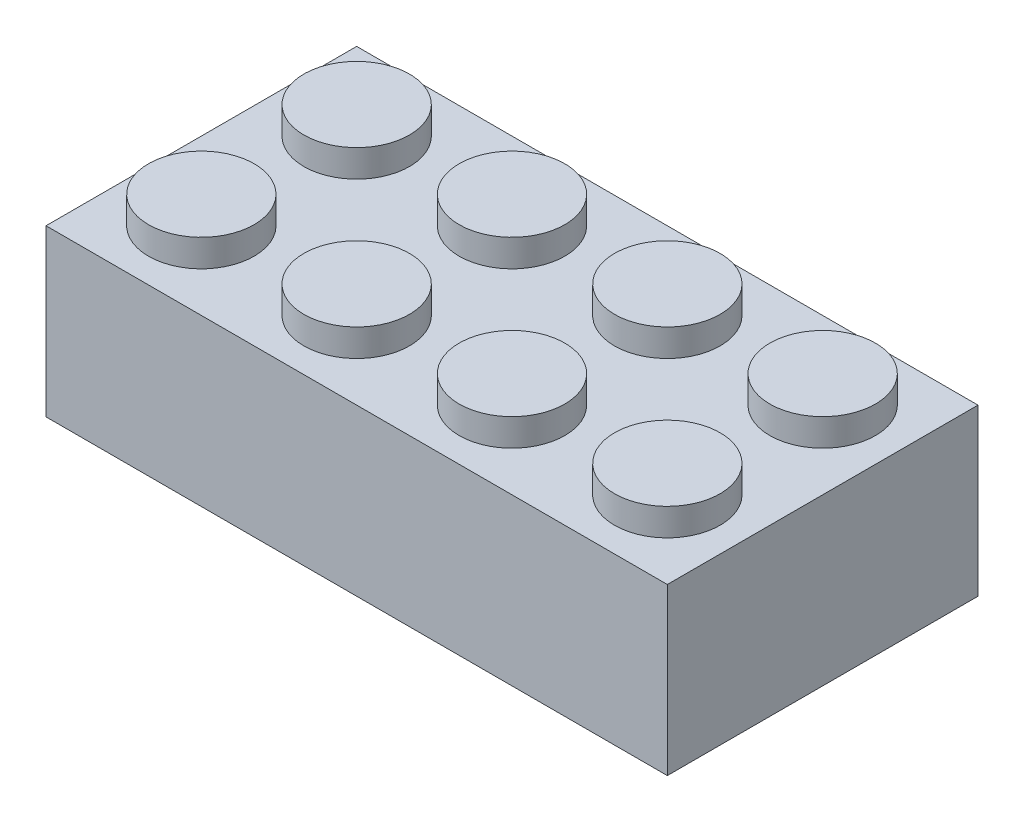
ISO-10303-21;
HEADER;
FILE_DESCRIPTION(('STEP AP214'),'2;1');
FILE_NAME('part.step','',(''),(''),'','','');
FILE_SCHEMA(('AUTOMOTIVE_DESIGN { 1 0 10303 214 1 1 1 1 }'));
ENDSEC;
DATA;
#1=APPLICATION_CONTEXT('core data for automotive mechanical design processes');
#2=APPLICATION_PROTOCOL_DEFINITION('international standard','automotive_design',2000,#1);
#3=PRODUCT_CONTEXT('',#1,'mechanical');
#4=PRODUCT('Part','Part','',(#3));
#5=PRODUCT_RELATED_PRODUCT_CATEGORY('part','',(#4));
#6=PRODUCT_DEFINITION_FORMATION('','',#4);
#7=PRODUCT_DEFINITION_CONTEXT('part definition',#1,'design');
#8=PRODUCT_DEFINITION('design','',#6,#7);
#9=PRODUCT_DEFINITION_SHAPE('','',#8);
#10=(LENGTH_UNIT() NAMED_UNIT(*) SI_UNIT(.MILLI.,.METRE.));
#11=(NAMED_UNIT(*) PLANE_ANGLE_UNIT() SI_UNIT($,.RADIAN.));
#12=(NAMED_UNIT(*) SI_UNIT($,.STERADIAN.) SOLID_ANGLE_UNIT());
#13=UNCERTAINTY_MEASURE_WITH_UNIT(LENGTH_MEASURE(1.E-05),#10,'distance_accuracy_value','');
#14=(GEOMETRIC_REPRESENTATION_CONTEXT(3) GLOBAL_UNCERTAINTY_ASSIGNED_CONTEXT((#13)) GLOBAL_UNIT_ASSIGNED_CONTEXT((#10,
#11,#12)) REPRESENTATION_CONTEXT('',''));
#15=CARTESIAN_POINT('',(0.,0.,0.));
#16=DIRECTION('',(0.,0.,1.));
#17=DIRECTION('',(1.,0.,0.));
#18=AXIS2_PLACEMENT_3D('',#15,#16,#17);
#19=CARTESIAN_POINT('',(15.875,4.2291,7.9375));
#20=DIRECTION('',(0.,1.,0.));
#21=DIRECTION('',(0.,0.,1.));
#22=AXIS2_PLACEMENT_3D('',#19,#20,#21);
#23=PLANE('',#22);
#24=CARTESIAN_POINT('',(11.90625,4.2291,3.96875));
#25=DIRECTION('',(0.,1.,0.));
#26=DIRECTION('',(0.,0.,1.));
#27=AXIS2_PLACEMENT_3D('',#24,#25,#26);
#28=CIRCLE('',#27,2.69875);
#29=CARTESIAN_POINT('',(11.90625,4.2291,6.6675));
#30=VERTEX_POINT('',#29);
#31=EDGE_CURVE('E692',#30,#30,#28,.T.);
#32=ORIENTED_EDGE('',*,*,#31,.F.);
#33=EDGE_LOOP('',(#32));
#34=FACE_BOUND('',#33,.T.);
#35=DIRECTION('',(0.,0.,-1.));
#36=VECTOR('',#35,1.);
#37=CARTESIAN_POINT('',(15.875,4.2291,-7.9375));
#38=LINE('',#37,#36);
#39=CARTESIAN_POINT('',(15.875,4.2291,7.9375));
#40=VERTEX_POINT('',#39);
#41=CARTESIAN_POINT('',(15.875,4.2291,-7.9375));
#42=VERTEX_POINT('',#41);
#43=EDGE_CURVE('E186',#40,#42,#38,.T.);
#44=ORIENTED_EDGE('',*,*,#43,.T.);
#45=DIRECTION('',(-1.,0.,0.));
#46=VECTOR('',#45,1.);
#47=CARTESIAN_POINT('',(-15.875,4.2291,-7.9375));
#48=LINE('',#47,#46);
#49=CARTESIAN_POINT('',(-15.875,4.2291,-7.9375));
#50=VERTEX_POINT('',#49);
#51=EDGE_CURVE('E116',#42,#50,#48,.T.);
#52=ORIENTED_EDGE('',*,*,#51,.T.);
#53=DIRECTION('',(0.,0.,1.));
#54=VECTOR('',#53,1.);
#55=CARTESIAN_POINT('',(-15.875,4.2291,-7.9375));
#56=LINE('',#55,#54);
#57=CARTESIAN_POINT('',(-15.875,4.2291,7.9375));
#58=VERTEX_POINT('',#57);
#59=EDGE_CURVE('E190',#50,#58,#56,.T.);
#60=ORIENTED_EDGE('',*,*,#59,.T.);
#61=DIRECTION('',(1.,0.,0.));
#62=VECTOR('',#61,1.);
#63=CARTESIAN_POINT('',(-15.875,4.2291,7.9375));
#64=LINE('',#63,#62);
#65=EDGE_CURVE('E86',#58,#40,#64,.T.);
#66=ORIENTED_EDGE('',*,*,#65,.T.);
#67=EDGE_LOOP('',(#44,#52,#60,#66));
#68=FACE_BOUND('',#67,.T.);
#69=CARTESIAN_POINT('',(3.96875000000001,4.2291,3.96875));
#70=DIRECTION('',(0.,1.,0.));
#71=DIRECTION('',(0.,0.,1.));
#72=AXIS2_PLACEMENT_3D('',#69,#70,#71);
#73=CIRCLE('',#72,2.69875);
#74=CARTESIAN_POINT('',(3.96875000000001,4.2291,6.6675));
#75=VERTEX_POINT('',#74);
#76=EDGE_CURVE('E684',#75,#75,#73,.T.);
#77=ORIENTED_EDGE('',*,*,#76,.F.);
#78=EDGE_LOOP('',(#77));
#79=FACE_BOUND('',#78,.T.);
#80=CARTESIAN_POINT('',(-3.96874999999999,4.2291,3.96875));
#81=DIRECTION('',(0.,1.,0.));
#82=DIRECTION('',(0.,0.,1.));
#83=AXIS2_PLACEMENT_3D('',#80,#81,#82);
#84=CIRCLE('',#83,2.69875);
#85=CARTESIAN_POINT('',(-3.96874999999999,4.2291,6.6675));
#86=VERTEX_POINT('',#85);
#87=EDGE_CURVE('E215',#86,#86,#84,.T.);
#88=ORIENTED_EDGE('',*,*,#87,.F.);
#89=EDGE_LOOP('',(#88));
#90=FACE_BOUND('',#89,.T.);
#91=CARTESIAN_POINT('',(-11.90625,4.2291,3.96875));
#92=DIRECTION('',(0.,1.,0.));
#93=DIRECTION('',(0.,0.,1.));
#94=AXIS2_PLACEMENT_3D('',#91,#92,#93);
#95=CIRCLE('',#94,2.69875);
#96=CARTESIAN_POINT('',(-11.90625,4.2291,6.6675));
#97=VERTEX_POINT('',#96);
#98=EDGE_CURVE('E223',#97,#97,#95,.T.);
#99=ORIENTED_EDGE('',*,*,#98,.F.);
#100=EDGE_LOOP('',(#99));
#101=FACE_BOUND('',#100,.T.);
#102=CARTESIAN_POINT('',(11.90625,4.2291,-3.96875));
#103=DIRECTION('',(0.,1.,0.));
#104=DIRECTION('',(0.,0.,1.));
#105=AXIS2_PLACEMENT_3D('',#102,#103,#104);
#106=CIRCLE('',#105,2.69875);
#107=CARTESIAN_POINT('',(11.90625,4.2291,-1.27));
#108=VERTEX_POINT('',#107);
#109=EDGE_CURVE('E231',#108,#108,#106,.T.);
#110=ORIENTED_EDGE('',*,*,#109,.F.);
#111=EDGE_LOOP('',(#110));
#112=FACE_BOUND('',#111,.T.);
#113=CARTESIAN_POINT('',(3.96875000000001,4.2291,-3.96875));
#114=DIRECTION('',(0.,1.,0.));
#115=DIRECTION('',(0.,0.,1.));
#116=AXIS2_PLACEMENT_3D('',#113,#114,#115);
#117=CIRCLE('',#116,2.69875);
#118=CARTESIAN_POINT('',(3.96875000000001,4.2291,-1.27));
#119=VERTEX_POINT('',#118);
#120=EDGE_CURVE('E237',#119,#119,#117,.T.);
#121=ORIENTED_EDGE('',*,*,#120,.F.);
#122=EDGE_LOOP('',(#121));
#123=FACE_BOUND('',#122,.T.);
#124=CARTESIAN_POINT('',(-3.96874999999999,4.2291,-3.96875));
#125=DIRECTION('',(0.,1.,0.));
#126=DIRECTION('',(0.,0.,1.));
#127=AXIS2_PLACEMENT_3D('',#124,#125,#126);
#128=CIRCLE('',#127,2.69875);
#129=CARTESIAN_POINT('',(-3.96874999999999,4.2291,-1.27));
#130=VERTEX_POINT('',#129);
#131=EDGE_CURVE('E245',#130,#130,#128,.T.);
#132=ORIENTED_EDGE('',*,*,#131,.F.);
#133=EDGE_LOOP('',(#132));
#134=FACE_BOUND('',#133,.T.);
#135=CARTESIAN_POINT('',(-11.90625,4.2291,-3.96875));
#136=DIRECTION('',(0.,1.,0.));
#137=DIRECTION('',(0.,0.,1.));
#138=AXIS2_PLACEMENT_3D('',#135,#136,#137);
#139=CIRCLE('',#138,2.69875);
#140=CARTESIAN_POINT('',(-11.90625,4.2291,-1.27));
#141=VERTEX_POINT('',#140);
#142=EDGE_CURVE('E251',#141,#141,#139,.T.);
#143=ORIENTED_EDGE('',*,*,#142,.F.);
#144=EDGE_LOOP('',(#143));
#145=FACE_BOUND('',#144,.T.);
#146=ADVANCED_FACE('F59',(#34,#68,#79,#90,#101,#112,#123,#134,#145),#23,.T.);
#147=CARTESIAN_POINT('',(15.875,4.2291,-7.9375));
#148=DIRECTION('',(-1.,0.,0.));
#149=DIRECTION('',(0.,0.,1.));
#150=AXIS2_PLACEMENT_3D('',#147,#148,#149);
#151=PLANE('',#150);
#152=DIRECTION('',(0.,0.,-1.));
#153=VECTOR('',#152,1.);
#154=CARTESIAN_POINT('',(15.875,-4.2291,-7.9375));
#155=LINE('',#154,#153);
#156=CARTESIAN_POINT('',(15.875,-4.2291,7.9375));
#157=VERTEX_POINT('',#156);
#158=CARTESIAN_POINT('',(15.875,-4.2291,-7.9375));
#159=VERTEX_POINT('',#158);
#160=EDGE_CURVE('E185',#157,#159,#155,.T.);
#161=ORIENTED_EDGE('',*,*,#160,.T.);
#162=DIRECTION('',(0.,-1.,0.));
#163=VECTOR('',#162,1.);
#164=CARTESIAN_POINT('',(15.875,4.2291,-7.9375));
#165=LINE('',#164,#163);
#166=EDGE_CURVE('E213',#42,#159,#165,.T.);
#167=ORIENTED_EDGE('',*,*,#166,.F.);
#168=ORIENTED_EDGE('',*,*,#43,.F.);
#169=DIRECTION('',(0.,-1.,0.));
#170=VECTOR('',#169,1.);
#171=CARTESIAN_POINT('',(15.875,4.2291,7.9375));
#172=LINE('',#171,#170);
#173=EDGE_CURVE('E194',#40,#157,#172,.T.);
#174=ORIENTED_EDGE('',*,*,#173,.T.);
#175=EDGE_LOOP('',(#161,#167,#168,#174));
#176=FACE_BOUND('',#175,.T.);
#177=ADVANCED_FACE('F293',(#176),#151,.F.);
#178=CARTESIAN_POINT('',(-15.875,4.2291,-7.9375));
#179=DIRECTION('',(0.,0.,1.));
#180=DIRECTION('',(1.,0.,0.));
#181=AXIS2_PLACEMENT_3D('',#178,#179,#180);
#182=PLANE('',#181);
#183=DIRECTION('',(-1.,0.,0.));
#184=VECTOR('',#183,1.);
#185=CARTESIAN_POINT('',(-15.875,-4.2291,-7.9375));
#186=LINE('',#185,#184);
#187=CARTESIAN_POINT('',(-15.875,-4.2291,-7.9375));
#188=VERTEX_POINT('',#187);
#189=EDGE_CURVE('E197',#159,#188,#186,.T.);
#190=ORIENTED_EDGE('',*,*,#189,.T.);
#191=DIRECTION('',(0.,-1.,0.));
#192=VECTOR('',#191,1.);
#193=CARTESIAN_POINT('',(-15.875,4.2291,-7.9375));
#194=LINE('',#193,#192);
#195=EDGE_CURVE('E209',#50,#188,#194,.T.);
#196=ORIENTED_EDGE('',*,*,#195,.F.);
#197=ORIENTED_EDGE('',*,*,#51,.F.);
#198=ORIENTED_EDGE('',*,*,#166,.T.);
#199=EDGE_LOOP('',(#190,#196,#197,#198));
#200=FACE_BOUND('',#199,.T.);
#201=ADVANCED_FACE('F298',(#200),#182,.F.);
#202=CARTESIAN_POINT('',(-15.875,4.2291,-7.9375));
#203=DIRECTION('',(1.,0.,0.));
#204=DIRECTION('',(0.,0.,-1.));
#205=AXIS2_PLACEMENT_3D('',#202,#203,#204);
#206=PLANE('',#205);
#207=DIRECTION('',(0.,0.,1.));
#208=VECTOR('',#207,1.);
#209=CARTESIAN_POINT('',(-15.875,-4.2291,-7.9375));
#210=LINE('',#209,#208);
#211=CARTESIAN_POINT('',(-15.875,-4.2291,7.9375));
#212=VERTEX_POINT('',#211);
#213=EDGE_CURVE('E199',#188,#212,#210,.T.);
#214=ORIENTED_EDGE('',*,*,#213,.T.);
#215=DIRECTION('',(0.,-1.,0.));
#216=VECTOR('',#215,1.);
#217=CARTESIAN_POINT('',(-15.875,4.2291,7.9375));
#218=LINE('',#217,#216);
#219=EDGE_CURVE('E206',#58,#212,#218,.T.);
#220=ORIENTED_EDGE('',*,*,#219,.F.);
#221=ORIENTED_EDGE('',*,*,#59,.F.);
#222=ORIENTED_EDGE('',*,*,#195,.T.);
#223=EDGE_LOOP('',(#214,#220,#221,#222));
#224=FACE_BOUND('',#223,.T.);
#225=ADVANCED_FACE('F310',(#224),#206,.F.);
#226=CARTESIAN_POINT('',(-15.875,4.2291,7.9375));
#227=DIRECTION('',(0.,0.,-1.));
#228=DIRECTION('',(-1.,0.,0.));
#229=AXIS2_PLACEMENT_3D('',#226,#227,#228);
#230=PLANE('',#229);
#231=DIRECTION('',(1.,0.,0.));
#232=VECTOR('',#231,1.);
#233=CARTESIAN_POINT('',(-15.875,-4.2291,7.9375));
#234=LINE('',#233,#232);
#235=EDGE_CURVE('E108',#212,#157,#234,.T.);
#236=ORIENTED_EDGE('',*,*,#235,.T.);
#237=ORIENTED_EDGE('',*,*,#173,.F.);
#238=ORIENTED_EDGE('',*,*,#65,.F.);
#239=ORIENTED_EDGE('',*,*,#219,.T.);
#240=EDGE_LOOP('',(#236,#237,#238,#239));
#241=FACE_BOUND('',#240,.T.);
#242=ADVANCED_FACE('F306',(#241),#230,.F.);
#243=CARTESIAN_POINT('',(15.875,-4.2291,7.9375));
#244=DIRECTION('',(0.,1.,0.));
#245=DIRECTION('',(0.,0.,1.));
#246=AXIS2_PLACEMENT_3D('',#243,#244,#245);
#247=PLANE('',#246);
#248=DIRECTION('',(0.,0.,1.));
#249=VECTOR('',#248,1.);
#250=CARTESIAN_POINT('',(14.605,-4.2291,-27.7520581765825));
#251=LINE('',#250,#249);
#252=CARTESIAN_POINT('',(14.605,-4.2291,-6.6675));
#253=VERTEX_POINT('',#252);
#254=CARTESIAN_POINT('',(14.605,-4.2291,6.6675));
#255=VERTEX_POINT('',#254);
#256=EDGE_CURVE('E167',#253,#255,#251,.T.);
#257=ORIENTED_EDGE('',*,*,#256,.F.);
#258=DIRECTION('',(1.,0.,0.));
#259=VECTOR('',#258,1.);
#260=CARTESIAN_POINT('',(0.,-4.2291,-6.6675));
#261=LINE('',#260,#259);
#262=CARTESIAN_POINT('',(-14.605,-4.2291,-6.6675));
#263=VERTEX_POINT('',#262);
#264=EDGE_CURVE('E156',#263,#253,#261,.T.);
#265=ORIENTED_EDGE('',*,*,#264,.F.);
#266=DIRECTION('',(0.,0.,-1.));
#267=VECTOR('',#266,1.);
#268=CARTESIAN_POINT('',(-14.605,-4.2291,-27.7520581765825));
#269=LINE('',#268,#267);
#270=CARTESIAN_POINT('',(-14.605,-4.2291,6.6675));
#271=VERTEX_POINT('',#270);
#272=EDGE_CURVE('E171',#271,#263,#269,.T.);
#273=ORIENTED_EDGE('',*,*,#272,.F.);
#274=DIRECTION('',(-1.,0.,0.));
#275=VECTOR('',#274,1.);
#276=CARTESIAN_POINT('',(0.,-4.2291,6.6675));
#277=LINE('',#276,#275);
#278=EDGE_CURVE('E77',#255,#271,#277,.T.);
#279=ORIENTED_EDGE('',*,*,#278,.F.);
#280=EDGE_LOOP('',(#257,#265,#273,#279));
#281=FACE_BOUND('',#280,.T.);
#282=ORIENTED_EDGE('',*,*,#160,.F.);
#283=ORIENTED_EDGE('',*,*,#235,.F.);
#284=ORIENTED_EDGE('',*,*,#213,.F.);
#285=ORIENTED_EDGE('',*,*,#189,.F.);
#286=EDGE_LOOP('',(#282,#283,#284,#285));
#287=FACE_BOUND('',#286,.T.);
#288=ADVANCED_FACE('F303',(#281,#287),#247,.F.);
#289=CARTESIAN_POINT('',(15.875,2.9591,7.9375));
#290=DIRECTION('',(0.,1.,0.));
#291=DIRECTION('',(0.,0.,1.));
#292=AXIS2_PLACEMENT_3D('',#289,#290,#291);
#293=PLANE('',#292);
#294=CARTESIAN_POINT('',(7.9375,2.9591,0.));
#295=DIRECTION('',(0.,1.,0.));
#296=DIRECTION('',(0.,0.,1.));
#297=AXIS2_PLACEMENT_3D('',#294,#295,#296);
#298=CIRCLE('',#297,3.175);
#299=CARTESIAN_POINT('',(7.9375,2.9591,3.175));
#300=VERTEX_POINT('',#299);
#301=EDGE_CURVE('E658',#300,#300,#298,.F.);
#302=ORIENTED_EDGE('',*,*,#301,.F.);
#303=EDGE_LOOP('',(#302));
#304=FACE_BOUND('',#303,.T.);
#305=CARTESIAN_POINT('',(-7.9375,2.9591,0.));
#306=DIRECTION('',(0.,1.,0.));
#307=DIRECTION('',(0.,0.,1.));
#308=AXIS2_PLACEMENT_3D('',#305,#306,#307);
#309=CIRCLE('',#308,3.175);
#310=CARTESIAN_POINT('',(-7.9375,2.9591,3.175));
#311=VERTEX_POINT('',#310);
#312=EDGE_CURVE('E670',#311,#311,#309,.F.);
#313=ORIENTED_EDGE('',*,*,#312,.F.);
#314=EDGE_LOOP('',(#313));
#315=FACE_BOUND('',#314,.T.);
#316=CARTESIAN_POINT('',(0.,2.9591,0.));
#317=DIRECTION('',(0.,1.,0.));
#318=DIRECTION('',(0.,0.,1.));
#319=AXIS2_PLACEMENT_3D('',#316,#317,#318);
#320=CIRCLE('',#319,3.175);
#321=CARTESIAN_POINT('',(0.,2.9591,3.175));
#322=VERTEX_POINT('',#321);
#323=EDGE_CURVE('E674',#322,#322,#320,.F.);
#324=ORIENTED_EDGE('',*,*,#323,.F.);
#325=EDGE_LOOP('',(#324));
#326=FACE_BOUND('',#325,.T.);
#327=DIRECTION('',(0.,0.,-1.));
#328=VECTOR('',#327,1.);
#329=CARTESIAN_POINT('',(-14.605,2.9591,-27.7520581765825));
#330=LINE('',#329,#328);
#331=CARTESIAN_POINT('',(-14.605,2.9591,6.6675));
#332=VERTEX_POINT('',#331);
#333=CARTESIAN_POINT('',(-14.605,2.9591,-6.6675));
#334=VERTEX_POINT('',#333);
#335=EDGE_CURVE('E160',#332,#334,#330,.T.);
#336=ORIENTED_EDGE('',*,*,#335,.T.);
#337=DIRECTION('',(1.,0.,0.));
#338=VECTOR('',#337,1.);
#339=CARTESIAN_POINT('',(0.,2.9591,-6.6675));
#340=LINE('',#339,#338);
#341=CARTESIAN_POINT('',(14.605,2.9591,-6.6675));
#342=VERTEX_POINT('',#341);
#343=EDGE_CURVE('E153',#334,#342,#340,.T.);
#344=ORIENTED_EDGE('',*,*,#343,.T.);
#345=DIRECTION('',(0.,0.,1.));
#346=VECTOR('',#345,1.);
#347=CARTESIAN_POINT('',(14.605,2.9591,-27.7520581765825));
#348=LINE('',#347,#346);
#349=CARTESIAN_POINT('',(14.605,2.9591,6.6675));
#350=VERTEX_POINT('',#349);
#351=EDGE_CURVE('E140',#342,#350,#348,.T.);
#352=ORIENTED_EDGE('',*,*,#351,.T.);
#353=DIRECTION('',(-1.,0.,0.));
#354=VECTOR('',#353,1.);
#355=CARTESIAN_POINT('',(0.,2.9591,6.6675));
#356=LINE('',#355,#354);
#357=EDGE_CURVE('E177',#350,#332,#356,.T.);
#358=ORIENTED_EDGE('',*,*,#357,.T.);
#359=EDGE_LOOP('',(#336,#344,#352,#358));
#360=FACE_BOUND('',#359,.T.);
#361=ADVANCED_FACE('F159',(#304,#315,#326,#360),#293,.F.);
#362=CARTESIAN_POINT('',(0.,36.3390100746172,-6.6675));
#363=DIRECTION('',(0.,0.,-1.));
#364=DIRECTION('',(-1.,0.,0.));
#365=AXIS2_PLACEMENT_3D('',#362,#363,#364);
#366=PLANE('',#365);
#367=DIRECTION('',(0.,-1.,0.));
#368=VECTOR('',#367,1.);
#369=CARTESIAN_POINT('',(-14.605,36.3390100746172,-6.6675));
#370=LINE('',#369,#368);
#371=EDGE_CURVE('E175',#334,#263,#370,.T.);
#372=ORIENTED_EDGE('',*,*,#371,.T.);
#373=ORIENTED_EDGE('',*,*,#264,.T.);
#374=DIRECTION('',(0.,-1.,0.));
#375=VECTOR('',#374,1.);
#376=CARTESIAN_POINT('',(14.605,36.3390100746172,-6.6675));
#377=LINE('',#376,#375);
#378=EDGE_CURVE('E144',#342,#253,#377,.T.);
#379=ORIENTED_EDGE('',*,*,#378,.F.);
#380=ORIENTED_EDGE('',*,*,#343,.F.);
#381=EDGE_LOOP('',(#372,#373,#379,#380));
#382=FACE_BOUND('',#381,.T.);
#383=ADVANCED_FACE('F152',(#382),#366,.F.);
#384=CARTESIAN_POINT('',(14.605,36.3390100746172,-27.7520581765825));
#385=DIRECTION('',(1.,0.,0.));
#386=DIRECTION('',(0.,0.,-1.));
#387=AXIS2_PLACEMENT_3D('',#384,#385,#386);
#388=PLANE('',#387);
#389=ORIENTED_EDGE('',*,*,#378,.T.);
#390=ORIENTED_EDGE('',*,*,#256,.T.);
#391=DIRECTION('',(0.,-1.,0.));
#392=VECTOR('',#391,1.);
#393=CARTESIAN_POINT('',(14.605,36.3390100746172,6.6675));
#394=LINE('',#393,#392);
#395=EDGE_CURVE('E146',#350,#255,#394,.T.);
#396=ORIENTED_EDGE('',*,*,#395,.F.);
#397=ORIENTED_EDGE('',*,*,#351,.F.);
#398=EDGE_LOOP('',(#389,#390,#396,#397));
#399=FACE_BOUND('',#398,.T.);
#400=ADVANCED_FACE('F142',(#399),#388,.F.);
#401=CARTESIAN_POINT('',(0.,36.3390100746172,6.6675));
#402=DIRECTION('',(0.,0.,1.));
#403=DIRECTION('',(1.,0.,0.));
#404=AXIS2_PLACEMENT_3D('',#401,#402,#403);
#405=PLANE('',#404);
#406=ORIENTED_EDGE('',*,*,#395,.T.);
#407=ORIENTED_EDGE('',*,*,#278,.T.);
#408=DIRECTION('',(0.,-1.,0.));
#409=VECTOR('',#408,1.);
#410=CARTESIAN_POINT('',(-14.605,36.3390100746172,6.6675));
#411=LINE('',#410,#409);
#412=EDGE_CURVE('E176',#332,#271,#411,.T.);
#413=ORIENTED_EDGE('',*,*,#412,.F.);
#414=ORIENTED_EDGE('',*,*,#357,.F.);
#415=EDGE_LOOP('',(#406,#407,#413,#414));
#416=FACE_BOUND('',#415,.T.);
#417=ADVANCED_FACE('F454',(#416),#405,.F.);
#418=CARTESIAN_POINT('',(-14.605,36.3390100746172,-27.7520581765825));
#419=DIRECTION('',(-1.,0.,0.));
#420=DIRECTION('',(0.,0.,1.));
#421=AXIS2_PLACEMENT_3D('',#418,#419,#420);
#422=PLANE('',#421);
#423=ORIENTED_EDGE('',*,*,#412,.T.);
#424=ORIENTED_EDGE('',*,*,#272,.T.);
#425=ORIENTED_EDGE('',*,*,#371,.F.);
#426=ORIENTED_EDGE('',*,*,#335,.F.);
#427=EDGE_LOOP('',(#423,#424,#425,#426));
#428=FACE_BOUND('',#427,.T.);
#429=ADVANCED_FACE('F446',(#428),#422,.F.);
#430=CARTESIAN_POINT('',(11.90625,5.6261,3.96875));
#431=DIRECTION('',(0.,-1.,0.));
#432=DIRECTION('',(0.,0.,-1.));
#433=AXIS2_PLACEMENT_3D('',#430,#431,#432);
#434=CYLINDRICAL_SURFACE('',#433,2.69875);
#435=CARTESIAN_POINT('',(11.90625,5.6261,3.96875));
#436=DIRECTION('',(0.,1.,0.));
#437=DIRECTION('',(0.,0.,1.));
#438=AXIS2_PLACEMENT_3D('',#435,#436,#437);
#439=CIRCLE('',#438,2.69875);
#440=CARTESIAN_POINT('',(11.90625,5.6261,6.6675));
#441=VERTEX_POINT('',#440);
#442=EDGE_CURVE('E693',#441,#441,#439,.T.);
#443=ORIENTED_EDGE('',*,*,#442,.F.);
#444=EDGE_LOOP('',(#443));
#445=FACE_BOUND('',#444,.T.);
#446=ORIENTED_EDGE('',*,*,#31,.T.);
#447=EDGE_LOOP('',(#446));
#448=FACE_BOUND('',#447,.T.);
#449=ADVANCED_FACE('F438',(#445,#448),#434,.T.);
#450=CARTESIAN_POINT('',(11.90625,5.6261,3.96875));
#451=DIRECTION('',(0.,1.,0.));
#452=DIRECTION('',(0.,0.,1.));
#453=AXIS2_PLACEMENT_3D('',#450,#451,#452);
#454=PLANE('',#453);
#455=ORIENTED_EDGE('',*,*,#442,.T.);
#456=EDGE_LOOP('',(#455));
#457=FACE_BOUND('',#456,.T.);
#458=ADVANCED_FACE('F429',(#457),#454,.T.);
#459=CARTESIAN_POINT('',(3.96875000000001,5.6261,3.96875));
#460=DIRECTION('',(0.,-1.,0.));
#461=DIRECTION('',(0.,0.,-1.));
#462=AXIS2_PLACEMENT_3D('',#459,#460,#461);
#463=CYLINDRICAL_SURFACE('',#462,2.69875);
#464=CARTESIAN_POINT('',(3.96875000000001,5.6261,3.96875));
#465=DIRECTION('',(0.,1.,0.));
#466=DIRECTION('',(0.,0.,1.));
#467=AXIS2_PLACEMENT_3D('',#464,#465,#466);
#468=CIRCLE('',#467,2.69875);
#469=CARTESIAN_POINT('',(3.96875000000001,5.6261,6.6675));
#470=VERTEX_POINT('',#469);
#471=EDGE_CURVE('E689',#470,#470,#468,.T.);
#472=ORIENTED_EDGE('',*,*,#471,.F.);
#473=EDGE_LOOP('',(#472));
#474=FACE_BOUND('',#473,.T.);
#475=ORIENTED_EDGE('',*,*,#76,.T.);
#476=EDGE_LOOP('',(#475));
#477=FACE_BOUND('',#476,.T.);
#478=ADVANCED_FACE('F421',(#474,#477),#463,.T.);
#479=CARTESIAN_POINT('',(3.96875000000001,5.6261,3.96875));
#480=DIRECTION('',(0.,1.,0.));
#481=DIRECTION('',(0.,0.,1.));
#482=AXIS2_PLACEMENT_3D('',#479,#480,#481);
#483=PLANE('',#482);
#484=ORIENTED_EDGE('',*,*,#471,.T.);
#485=EDGE_LOOP('',(#484));
#486=FACE_BOUND('',#485,.T.);
#487=ADVANCED_FACE('F324',(#486),#483,.T.);
#488=CARTESIAN_POINT('',(-3.96874999999999,5.6261,3.96875));
#489=DIRECTION('',(0.,1.,0.));
#490=DIRECTION('',(0.,0.,1.));
#491=AXIS2_PLACEMENT_3D('',#488,#489,#490);
#492=PLANE('',#491);
#493=CARTESIAN_POINT('',(-3.96874999999999,5.6261,3.96875));
#494=DIRECTION('',(0.,1.,0.));
#495=DIRECTION('',(0.,0.,1.));
#496=AXIS2_PLACEMENT_3D('',#493,#494,#495);
#497=CIRCLE('',#496,2.69875);
#498=CARTESIAN_POINT('',(-3.96874999999999,5.6261,6.6675));
#499=VERTEX_POINT('',#498);
#500=EDGE_CURVE('E219',#499,#499,#497,.T.);
#501=ORIENTED_EDGE('',*,*,#500,.T.);
#502=EDGE_LOOP('',(#501));
#503=FACE_BOUND('',#502,.T.);
#504=ADVANCED_FACE('F320',(#503),#492,.T.);
#505=CARTESIAN_POINT('',(-3.96874999999999,5.6261,3.96875));
#506=DIRECTION('',(0.,-1.,0.));
#507=DIRECTION('',(0.,0.,-1.));
#508=AXIS2_PLACEMENT_3D('',#505,#506,#507);
#509=CYLINDRICAL_SURFACE('',#508,2.69875);
#510=ORIENTED_EDGE('',*,*,#500,.F.);
#511=EDGE_LOOP('',(#510));
#512=FACE_BOUND('',#511,.T.);
#513=ORIENTED_EDGE('',*,*,#87,.T.);
#514=EDGE_LOOP('',(#513));
#515=FACE_BOUND('',#514,.T.);
#516=ADVANCED_FACE('F316',(#512,#515),#509,.T.);
#517=CARTESIAN_POINT('',(-11.90625,5.6261,3.96875));
#518=DIRECTION('',(0.,1.,0.));
#519=DIRECTION('',(0.,0.,1.));
#520=AXIS2_PLACEMENT_3D('',#517,#518,#519);
#521=PLANE('',#520);
#522=CARTESIAN_POINT('',(-11.90625,5.6261,3.96875));
#523=DIRECTION('',(0.,1.,0.));
#524=DIRECTION('',(0.,0.,1.));
#525=AXIS2_PLACEMENT_3D('',#522,#523,#524);
#526=CIRCLE('',#525,2.69875);
#527=CARTESIAN_POINT('',(-11.90625,5.6261,6.6675));
#528=VERTEX_POINT('',#527);
#529=EDGE_CURVE('E227',#528,#528,#526,.T.);
#530=ORIENTED_EDGE('',*,*,#529,.T.);
#531=EDGE_LOOP('',(#530));
#532=FACE_BOUND('',#531,.T.);
#533=ADVANCED_FACE('F319',(#532),#521,.T.);
#534=CARTESIAN_POINT('',(-11.90625,5.6261,3.96875));
#535=DIRECTION('',(0.,-1.,0.));
#536=DIRECTION('',(0.,0.,-1.));
#537=AXIS2_PLACEMENT_3D('',#534,#535,#536);
#538=CYLINDRICAL_SURFACE('',#537,2.69875);
#539=ORIENTED_EDGE('',*,*,#529,.F.);
#540=EDGE_LOOP('',(#539));
#541=FACE_BOUND('',#540,.T.);
#542=ORIENTED_EDGE('',*,*,#98,.T.);
#543=EDGE_LOOP('',(#542));
#544=FACE_BOUND('',#543,.T.);
#545=ADVANCED_FACE('F326',(#541,#544),#538,.T.);
#546=CARTESIAN_POINT('',(11.90625,5.6261,-3.96875));
#547=DIRECTION('',(0.,1.,0.));
#548=DIRECTION('',(0.,0.,1.));
#549=AXIS2_PLACEMENT_3D('',#546,#547,#548);
#550=PLANE('',#549);
#551=CARTESIAN_POINT('',(11.90625,5.6261,-3.96875));
#552=DIRECTION('',(0.,1.,0.));
#553=DIRECTION('',(0.,0.,1.));
#554=AXIS2_PLACEMENT_3D('',#551,#552,#553);
#555=CIRCLE('',#554,2.69875);
#556=CARTESIAN_POINT('',(11.90625,5.6261,-1.27));
#557=VERTEX_POINT('',#556);
#558=EDGE_CURVE('E234',#557,#557,#555,.T.);
#559=ORIENTED_EDGE('',*,*,#558,.T.);
#560=EDGE_LOOP('',(#559));
#561=FACE_BOUND('',#560,.T.);
#562=ADVANCED_FACE('F329',(#561),#550,.T.);
#563=CARTESIAN_POINT('',(11.90625,5.6261,-3.96875));
#564=DIRECTION('',(0.,-1.,0.));
#565=DIRECTION('',(0.,0.,-1.));
#566=AXIS2_PLACEMENT_3D('',#563,#564,#565);
#567=CYLINDRICAL_SURFACE('',#566,2.69875);
#568=ORIENTED_EDGE('',*,*,#558,.F.);
#569=EDGE_LOOP('',(#568));
#570=FACE_BOUND('',#569,.T.);
#571=ORIENTED_EDGE('',*,*,#109,.T.);
#572=EDGE_LOOP('',(#571));
#573=FACE_BOUND('',#572,.T.);
#574=ADVANCED_FACE('F334',(#570,#573),#567,.T.);
#575=CARTESIAN_POINT('',(3.96875000000001,5.6261,-3.96875));
#576=DIRECTION('',(0.,1.,0.));
#577=DIRECTION('',(0.,0.,1.));
#578=AXIS2_PLACEMENT_3D('',#575,#576,#577);
#579=PLANE('',#578);
#580=CARTESIAN_POINT('',(3.96875000000001,5.6261,-3.96875));
#581=DIRECTION('',(0.,1.,0.));
#582=DIRECTION('',(0.,0.,1.));
#583=AXIS2_PLACEMENT_3D('',#580,#581,#582);
#584=CIRCLE('',#583,2.69875);
#585=CARTESIAN_POINT('',(3.96875000000001,5.6261,-1.27));
#586=VERTEX_POINT('',#585);
#587=EDGE_CURVE('E241',#586,#586,#584,.T.);
#588=ORIENTED_EDGE('',*,*,#587,.T.);
#589=EDGE_LOOP('',(#588));
#590=FACE_BOUND('',#589,.T.);
#591=ADVANCED_FACE('F337',(#590),#579,.T.);
#592=CARTESIAN_POINT('',(3.96875000000001,5.6261,-3.96875));
#593=DIRECTION('',(0.,-1.,0.));
#594=DIRECTION('',(0.,0.,-1.));
#595=AXIS2_PLACEMENT_3D('',#592,#593,#594);
#596=CYLINDRICAL_SURFACE('',#595,2.69875);
#597=ORIENTED_EDGE('',*,*,#587,.F.);
#598=EDGE_LOOP('',(#597));
#599=FACE_BOUND('',#598,.T.);
#600=ORIENTED_EDGE('',*,*,#120,.T.);
#601=EDGE_LOOP('',(#600));
#602=FACE_BOUND('',#601,.T.);
#603=ADVANCED_FACE('F342',(#599,#602),#596,.T.);
#604=CARTESIAN_POINT('',(-3.96874999999999,5.6261,-3.96875));
#605=DIRECTION('',(0.,1.,0.));
#606=DIRECTION('',(0.,0.,1.));
#607=AXIS2_PLACEMENT_3D('',#604,#605,#606);
#608=PLANE('',#607);
#609=CARTESIAN_POINT('',(-3.96874999999999,5.6261,-3.96875));
#610=DIRECTION('',(0.,1.,0.));
#611=DIRECTION('',(0.,0.,1.));
#612=AXIS2_PLACEMENT_3D('',#609,#610,#611);
#613=CIRCLE('',#612,2.69875);
#614=CARTESIAN_POINT('',(-3.96874999999999,5.6261,-1.27));
#615=VERTEX_POINT('',#614);
#616=EDGE_CURVE('E248',#615,#615,#613,.T.);
#617=ORIENTED_EDGE('',*,*,#616,.T.);
#618=EDGE_LOOP('',(#617));
#619=FACE_BOUND('',#618,.T.);
#620=ADVANCED_FACE('F345',(#619),#608,.T.);
#621=CARTESIAN_POINT('',(-3.96874999999999,5.6261,-3.96875));
#622=DIRECTION('',(0.,-1.,0.));
#623=DIRECTION('',(0.,0.,-1.));
#624=AXIS2_PLACEMENT_3D('',#621,#622,#623);
#625=CYLINDRICAL_SURFACE('',#624,2.69875);
#626=ORIENTED_EDGE('',*,*,#616,.F.);
#627=EDGE_LOOP('',(#626));
#628=FACE_BOUND('',#627,.T.);
#629=ORIENTED_EDGE('',*,*,#131,.T.);
#630=EDGE_LOOP('',(#629));
#631=FACE_BOUND('',#630,.T.);
#632=ADVANCED_FACE('F350',(#628,#631),#625,.T.);
#633=CARTESIAN_POINT('',(-11.90625,5.6261,-3.96875));
#634=DIRECTION('',(0.,1.,0.));
#635=DIRECTION('',(0.,0.,1.));
#636=AXIS2_PLACEMENT_3D('',#633,#634,#635);
#637=PLANE('',#636);
#638=CARTESIAN_POINT('',(-11.90625,5.6261,-3.96875));
#639=DIRECTION('',(0.,1.,0.));
#640=DIRECTION('',(0.,0.,1.));
#641=AXIS2_PLACEMENT_3D('',#638,#639,#640);
#642=CIRCLE('',#641,2.69875);
#643=CARTESIAN_POINT('',(-11.90625,5.6261,-1.27));
#644=VERTEX_POINT('',#643);
#645=EDGE_CURVE('E254',#644,#644,#642,.T.);
#646=ORIENTED_EDGE('',*,*,#645,.T.);
#647=EDGE_LOOP('',(#646));
#648=FACE_BOUND('',#647,.T.);
#649=ADVANCED_FACE('F61',(#648),#637,.T.);
#650=CARTESIAN_POINT('',(-11.90625,5.6261,-3.96875));
#651=DIRECTION('',(0.,-1.,0.));
#652=DIRECTION('',(0.,0.,-1.));
#653=AXIS2_PLACEMENT_3D('',#650,#651,#652);
#654=CYLINDRICAL_SURFACE('',#653,2.69875);
#655=ORIENTED_EDGE('',*,*,#645,.F.);
#656=EDGE_LOOP('',(#655));
#657=FACE_BOUND('',#656,.T.);
#658=ORIENTED_EDGE('',*,*,#142,.T.);
#659=EDGE_LOOP('',(#658));
#660=FACE_BOUND('',#659,.T.);
#661=ADVANCED_FACE('F356',(#657,#660),#654,.T.);
#662=CARTESIAN_POINT('',(0.,11.9393561210692,0.));
#663=DIRECTION('',(0.,-1.,0.));
#664=DIRECTION('',(0.,0.,-1.));
#665=AXIS2_PLACEMENT_3D('',#662,#663,#664);
#666=CYLINDRICAL_SURFACE('',#665,2.413);
#667=CARTESIAN_POINT('',(0.,-4.2291,0.));
#668=DIRECTION('',(0.,-1.,0.));
#669=DIRECTION('',(0.,0.,-1.));
#670=AXIS2_PLACEMENT_3D('',#667,#668,#669);
#671=CIRCLE('',#670,2.413);
#672=CARTESIAN_POINT('',(0.,-4.2291,-2.413));
#673=VERTEX_POINT('',#672);
#674=EDGE_CURVE('E678',#673,#673,#671,.T.);
#675=ORIENTED_EDGE('',*,*,#674,.T.);
#676=EDGE_LOOP('',(#675));
#677=FACE_BOUND('',#676,.T.);
#678=CARTESIAN_POINT('',(0.,2.9591,0.));
#679=DIRECTION('',(0.,1.,0.));
#680=DIRECTION('',(0.,0.,1.));
#681=AXIS2_PLACEMENT_3D('',#678,#679,#680);
#682=CIRCLE('',#681,2.413);
#683=CARTESIAN_POINT('',(0.,2.9591,2.413));
#684=VERTEX_POINT('',#683);
#685=EDGE_CURVE('E258',#684,#684,#682,.T.);
#686=ORIENTED_EDGE('',*,*,#685,.T.);
#687=EDGE_LOOP('',(#686));
#688=FACE_BOUND('',#687,.T.);
#689=ADVANCED_FACE('F358',(#677,#688),#666,.F.);
#690=CARTESIAN_POINT('',(0.,-4.2291,-27.7520581765825));
#691=DIRECTION('',(0.,-1.,0.));
#692=DIRECTION('',(0.,0.,-1.));
#693=AXIS2_PLACEMENT_3D('',#690,#691,#692);
#694=PLANE('',#693);
#695=ORIENTED_EDGE('',*,*,#674,.F.);
#696=EDGE_LOOP('',(#695));
#697=FACE_BOUND('',#696,.T.);
#698=CARTESIAN_POINT('',(0.,-4.2291,0.));
#699=DIRECTION('',(0.,-1.,0.));
#700=DIRECTION('',(0.,0.,-1.));
#701=AXIS2_PLACEMENT_3D('',#698,#699,#700);
#702=CIRCLE('',#701,3.175);
#703=CARTESIAN_POINT('',(0.,-4.2291,-3.175));
#704=VERTEX_POINT('',#703);
#705=EDGE_CURVE('E681',#704,#704,#702,.T.);
#706=ORIENTED_EDGE('',*,*,#705,.T.);
#707=EDGE_LOOP('',(#706));
#708=FACE_BOUND('',#707,.T.);
#709=ADVANCED_FACE('F364',(#697,#708),#694,.T.);
#710=CARTESIAN_POINT('',(0.,11.9393561210692,0.));
#711=DIRECTION('',(0.,-1.,0.));
#712=DIRECTION('',(0.,0.,-1.));
#713=AXIS2_PLACEMENT_3D('',#710,#711,#712);
#714=CYLINDRICAL_SURFACE('',#713,3.175);
#715=ORIENTED_EDGE('',*,*,#705,.F.);
#716=EDGE_LOOP('',(#715));
#717=FACE_BOUND('',#716,.T.);
#718=ORIENTED_EDGE('',*,*,#323,.T.);
#719=EDGE_LOOP('',(#718));
#720=FACE_BOUND('',#719,.T.);
#721=ADVANCED_FACE('F287',(#717,#720),#714,.T.);
#722=ORIENTED_EDGE('',*,*,#685,.F.);
#723=EDGE_LOOP('',(#722));
#724=FACE_BOUND('',#723,.T.);
#725=ADVANCED_FACE('F272',(#724),#293,.F.);
#726=CARTESIAN_POINT('',(-7.9375,11.9393561210692,0.));
#727=DIRECTION('',(0.,-1.,0.));
#728=DIRECTION('',(0.,0.,-1.));
#729=AXIS2_PLACEMENT_3D('',#726,#727,#728);
#730=CYLINDRICAL_SURFACE('',#729,2.413);
#731=CARTESIAN_POINT('',(-7.9375,-4.2291,0.));
#732=DIRECTION('',(0.,-1.,0.));
#733=DIRECTION('',(0.,0.,-1.));
#734=AXIS2_PLACEMENT_3D('',#731,#732,#733);
#735=CIRCLE('',#734,2.413);
#736=CARTESIAN_POINT('',(-7.9375,-4.2291,-2.413));
#737=VERTEX_POINT('',#736);
#738=EDGE_CURVE('E665',#737,#737,#735,.T.);
#739=ORIENTED_EDGE('',*,*,#738,.T.);
#740=EDGE_LOOP('',(#739));
#741=FACE_BOUND('',#740,.T.);
#742=CARTESIAN_POINT('',(-7.9375,2.9591,0.));
#743=DIRECTION('',(0.,1.,0.));
#744=DIRECTION('',(0.,0.,1.));
#745=AXIS2_PLACEMENT_3D('',#742,#743,#744);
#746=CIRCLE('',#745,2.413);
#747=CARTESIAN_POINT('',(-7.9375,2.9591,2.413));
#748=VERTEX_POINT('',#747);
#749=EDGE_CURVE('E67',#748,#748,#746,.T.);
#750=ORIENTED_EDGE('',*,*,#749,.T.);
#751=EDGE_LOOP('',(#750));
#752=FACE_BOUND('',#751,.T.);
#753=ADVANCED_FACE('F265',(#741,#752),#730,.F.);
#754=CARTESIAN_POINT('',(-7.93749999999999,-4.2291,-27.7520581765825));
#755=DIRECTION('',(0.,-1.,0.));
#756=DIRECTION('',(0.,0.,-1.));
#757=AXIS2_PLACEMENT_3D('',#754,#755,#756);
#758=PLANE('',#757);
#759=ORIENTED_EDGE('',*,*,#738,.F.);
#760=EDGE_LOOP('',(#759));
#761=FACE_BOUND('',#760,.T.);
#762=CARTESIAN_POINT('',(-7.9375,-4.2291,0.));
#763=DIRECTION('',(0.,-1.,0.));
#764=DIRECTION('',(0.,0.,-1.));
#765=AXIS2_PLACEMENT_3D('',#762,#763,#764);
#766=CIRCLE('',#765,3.175);
#767=CARTESIAN_POINT('',(-7.9375,-4.2291,-3.175));
#768=VERTEX_POINT('',#767);
#769=EDGE_CURVE('E669',#768,#768,#766,.T.);
#770=ORIENTED_EDGE('',*,*,#769,.T.);
#771=EDGE_LOOP('',(#770));
#772=FACE_BOUND('',#771,.T.);
#773=ADVANCED_FACE('F281',(#761,#772),#758,.T.);
#774=CARTESIAN_POINT('',(-7.9375,11.9393561210692,0.));
#775=DIRECTION('',(0.,-1.,0.));
#776=DIRECTION('',(0.,0.,-1.));
#777=AXIS2_PLACEMENT_3D('',#774,#775,#776);
#778=CYLINDRICAL_SURFACE('',#777,3.175);
#779=ORIENTED_EDGE('',*,*,#769,.F.);
#780=EDGE_LOOP('',(#779));
#781=FACE_BOUND('',#780,.T.);
#782=ORIENTED_EDGE('',*,*,#312,.T.);
#783=EDGE_LOOP('',(#782));
#784=FACE_BOUND('',#783,.T.);
#785=ADVANCED_FACE('F270',(#781,#784),#778,.T.);
#786=ORIENTED_EDGE('',*,*,#749,.F.);
#787=EDGE_LOOP('',(#786));
#788=FACE_BOUND('',#787,.T.);
#789=ADVANCED_FACE('F267',(#788),#293,.F.);
#790=CARTESIAN_POINT('',(7.9375,11.9393561210692,0.));
#791=DIRECTION('',(0.,-1.,0.));
#792=DIRECTION('',(0.,0.,-1.));
#793=AXIS2_PLACEMENT_3D('',#790,#791,#792);
#794=CYLINDRICAL_SURFACE('',#793,2.413);
#795=CARTESIAN_POINT('',(7.9375,-4.2291,0.));
#796=DIRECTION('',(0.,-1.,0.));
#797=DIRECTION('',(0.,0.,-1.));
#798=AXIS2_PLACEMENT_3D('',#795,#796,#797);
#799=CIRCLE('',#798,2.413);
#800=CARTESIAN_POINT('',(7.9375,-4.2291,-2.413));
#801=VERTEX_POINT('',#800);
#802=EDGE_CURVE('E659',#801,#801,#799,.T.);
#803=ORIENTED_EDGE('',*,*,#802,.T.);
#804=EDGE_LOOP('',(#803));
#805=FACE_BOUND('',#804,.T.);
#806=CARTESIAN_POINT('',(7.9375,2.9591,0.));
#807=DIRECTION('',(0.,1.,0.));
#808=DIRECTION('',(0.,0.,1.));
#809=AXIS2_PLACEMENT_3D('',#806,#807,#808);
#810=CIRCLE('',#809,2.413);
#811=CARTESIAN_POINT('',(7.9375,2.9591,2.413));
#812=VERTEX_POINT('',#811);
#813=EDGE_CURVE('E14',#812,#812,#810,.T.);
#814=ORIENTED_EDGE('',*,*,#813,.T.);
#815=EDGE_LOOP('',(#814));
#816=FACE_BOUND('',#815,.T.);
#817=ADVANCED_FACE('F269',(#805,#816),#794,.F.);
#818=CARTESIAN_POINT('',(7.93750000000001,-4.2291,-27.7520581765825));
#819=DIRECTION('',(0.,-1.,0.));
#820=DIRECTION('',(0.,0.,-1.));
#821=AXIS2_PLACEMENT_3D('',#818,#819,#820);
#822=PLANE('',#821);
#823=ORIENTED_EDGE('',*,*,#802,.F.);
#824=EDGE_LOOP('',(#823));
#825=FACE_BOUND('',#824,.T.);
#826=CARTESIAN_POINT('',(7.9375,-4.2291,0.));
#827=DIRECTION('',(0.,-1.,0.));
#828=DIRECTION('',(0.,0.,-1.));
#829=AXIS2_PLACEMENT_3D('',#826,#827,#828);
#830=CIRCLE('',#829,3.175);
#831=CARTESIAN_POINT('',(7.9375,-4.2291,-3.175));
#832=VERTEX_POINT('',#831);
#833=EDGE_CURVE('E655',#832,#832,#830,.T.);
#834=ORIENTED_EDGE('',*,*,#833,.T.);
#835=EDGE_LOOP('',(#834));
#836=FACE_BOUND('',#835,.T.);
#837=ADVANCED_FACE('F278',(#825,#836),#822,.T.);
#838=CARTESIAN_POINT('',(7.9375,11.9393561210692,0.));
#839=DIRECTION('',(0.,-1.,0.));
#840=DIRECTION('',(0.,0.,-1.));
#841=AXIS2_PLACEMENT_3D('',#838,#839,#840);
#842=CYLINDRICAL_SURFACE('',#841,3.175);
#843=ORIENTED_EDGE('',*,*,#833,.F.);
#844=EDGE_LOOP('',(#843));
#845=FACE_BOUND('',#844,.T.);
#846=ORIENTED_EDGE('',*,*,#301,.T.);
#847=EDGE_LOOP('',(#846));
#848=FACE_BOUND('',#847,.T.);
#849=ADVANCED_FACE('F290',(#845,#848),#842,.T.);
#850=ORIENTED_EDGE('',*,*,#813,.F.);
#851=EDGE_LOOP('',(#850));
#852=FACE_BOUND('',#851,.T.);
#853=ADVANCED_FACE('F273',(#852),#293,.F.);
#854=CLOSED_SHELL('',(#146,#177,#201,#225,#242,#288,#361,#383,#400,#417,#429,#449,#458,#478,
#487,#504,#516,#533,#545,#562,#574,#591,#603,#620,#632,#649,#661,#689,#709,#721,#725,#753,#773,
#785,#789,#817,#837,#849,#853));
#855=MANIFOLD_SOLID_BREP('B2',#854);
#856=ADVANCED_BREP_SHAPE_REPRESENTATION('',(#18,#855),#14);
#857=SHAPE_DEFINITION_REPRESENTATION(#9,#856);
ENDSEC;
END-ISO-10303-21;
